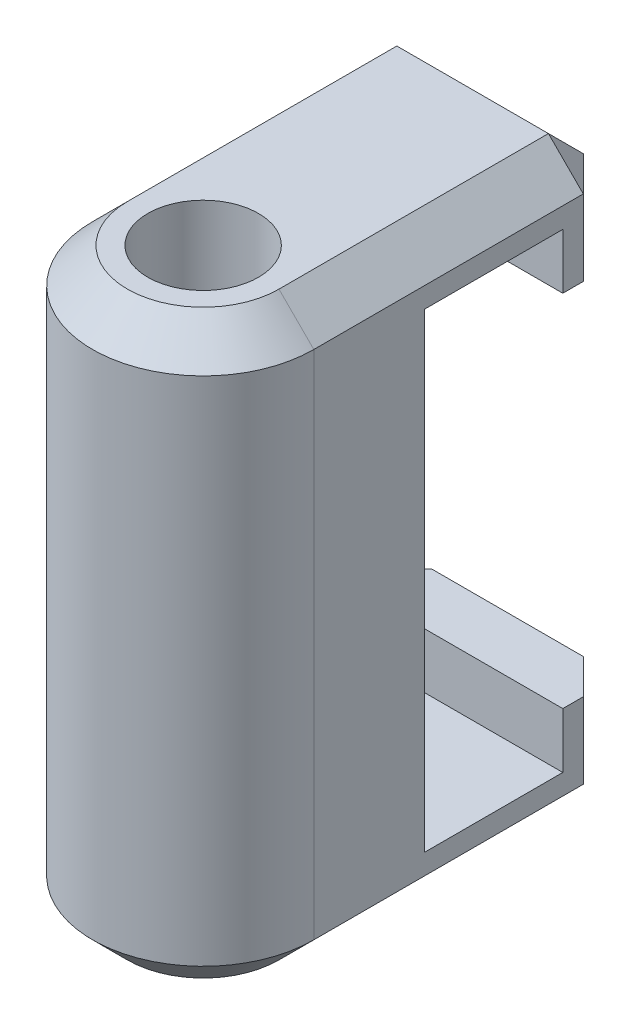
ISO-10303-21;
HEADER;
FILE_DESCRIPTION(('STEP AP214'),'2;1');
FILE_NAME('part.step','',(''),(''),'','','');
FILE_SCHEMA(('AUTOMOTIVE_DESIGN { 1 0 10303 214 1 1 1 1 }'));
ENDSEC;
DATA;
#1=APPLICATION_CONTEXT('core data for automotive mechanical design processes');
#2=APPLICATION_PROTOCOL_DEFINITION('international standard','automotive_design',2000,#1);
#3=PRODUCT_CONTEXT('',#1,'mechanical');
#4=PRODUCT('Part','Part','',(#3));
#5=PRODUCT_RELATED_PRODUCT_CATEGORY('part','',(#4));
#6=PRODUCT_DEFINITION_FORMATION('','',#4);
#7=PRODUCT_DEFINITION_CONTEXT('part definition',#1,'design');
#8=PRODUCT_DEFINITION('design','',#6,#7);
#9=PRODUCT_DEFINITION_SHAPE('','',#8);
#10=(LENGTH_UNIT() NAMED_UNIT(*) SI_UNIT(.MILLI.,.METRE.));
#11=(NAMED_UNIT(*) PLANE_ANGLE_UNIT() SI_UNIT($,.RADIAN.));
#12=(NAMED_UNIT(*) SI_UNIT($,.STERADIAN.) SOLID_ANGLE_UNIT());
#13=UNCERTAINTY_MEASURE_WITH_UNIT(LENGTH_MEASURE(1.E-05),#10,'distance_accuracy_value','');
#14=(GEOMETRIC_REPRESENTATION_CONTEXT(3) GLOBAL_UNCERTAINTY_ASSIGNED_CONTEXT((#13)) GLOBAL_UNIT_ASSIGNED_CONTEXT((#10,
#11,#12)) REPRESENTATION_CONTEXT('',''));
#15=CARTESIAN_POINT('',(0.,0.,0.));
#16=DIRECTION('',(0.,0.,1.));
#17=DIRECTION('',(1.,0.,0.));
#18=AXIS2_PLACEMENT_3D('',#15,#16,#17);
#19=CARTESIAN_POINT('',(-3.175,16.66875,-8.73125));
#20=DIRECTION('',(0.,0.,1.));
#21=DIRECTION('',(1.,0.,0.));
#22=AXIS2_PLACEMENT_3D('',#19,#20,#21);
#23=PLANE('',#22);
#24=DIRECTION('',(1.,0.,0.));
#25=VECTOR('',#24,1.);
#26=CARTESIAN_POINT('',(-3.175,3.175,-8.73125));
#27=LINE('',#26,#25);
#28=CARTESIAN_POINT('',(-2.175,3.175,-8.73125));
#29=VERTEX_POINT('',#28);
#30=CARTESIAN_POINT('',(2.175,3.175,-8.73125));
#31=VERTEX_POINT('',#30);
#32=EDGE_CURVE('E234',#29,#31,#27,.T.);
#33=ORIENTED_EDGE('',*,*,#32,.T.);
#34=DIRECTION('',(0.,-1.,0.));
#35=VECTOR('',#34,1.);
#36=CARTESIAN_POINT('',(2.175,16.66875,-8.73125));
#37=LINE('',#36,#35);
#38=CARTESIAN_POINT('',(2.175,0.999999999999997,-8.73125));
#39=VERTEX_POINT('',#38);
#40=EDGE_CURVE('E263',#31,#39,#37,.T.);
#41=ORIENTED_EDGE('',*,*,#40,.T.);
#42=DIRECTION('',(-1.,0.,0.));
#43=VECTOR('',#42,1.);
#44=CARTESIAN_POINT('',(-3.175,0.999999999999997,-8.73125));
#45=LINE('',#44,#43);
#46=CARTESIAN_POINT('',(-2.175,0.999999999999997,-8.73125));
#47=VERTEX_POINT('',#46);
#48=EDGE_CURVE('E259',#39,#47,#45,.T.);
#49=ORIENTED_EDGE('',*,*,#48,.T.);
#50=DIRECTION('',(0.,1.,0.));
#51=VECTOR('',#50,1.);
#52=CARTESIAN_POINT('',(-2.175,16.66875,-8.73125));
#53=LINE('',#52,#51);
#54=EDGE_CURVE('E261',#47,#29,#53,.T.);
#55=ORIENTED_EDGE('',*,*,#54,.T.);
#56=EDGE_LOOP('',(#33,#41,#49,#55));
#57=FACE_BOUND('',#56,.T.);
#58=ADVANCED_FACE('F35',(#57),#23,.F.);
#59=CARTESIAN_POINT('',(0.,16.66875,0.));
#60=DIRECTION('',(0.,1.,0.));
#61=DIRECTION('',(0.,0.,1.));
#62=AXIS2_PLACEMENT_3D('',#59,#60,#61);
#63=PLANE('',#62);
#64=DIRECTION('',(0.,0.,-1.));
#65=VECTOR('',#64,1.);
#66=CARTESIAN_POINT('',(2.175,16.66875,-8.73125));
#67=LINE('',#66,#65);
#68=CARTESIAN_POINT('',(2.175,16.66875,0.));
#69=VERTEX_POINT('',#68);
#70=CARTESIAN_POINT('',(2.175,16.66875,-7.73125));
#71=VERTEX_POINT('',#70);
#72=EDGE_CURVE('E309',#69,#71,#67,.T.);
#73=ORIENTED_EDGE('',*,*,#72,.T.);
#74=DIRECTION('',(-1.,0.,0.));
#75=VECTOR('',#74,1.);
#76=CARTESIAN_POINT('',(-3.175,16.66875,-7.73125));
#77=LINE('',#76,#75);
#78=CARTESIAN_POINT('',(-2.175,16.66875,-7.73125));
#79=VERTEX_POINT('',#78);
#80=EDGE_CURVE('E11',#71,#79,#77,.T.);
#81=ORIENTED_EDGE('',*,*,#80,.T.);
#82=DIRECTION('',(0.,0.,1.));
#83=VECTOR('',#82,1.);
#84=CARTESIAN_POINT('',(-2.175,16.66875,0.));
#85=LINE('',#84,#83);
#86=CARTESIAN_POINT('',(-2.175,16.66875,0.));
#87=VERTEX_POINT('',#86);
#88=EDGE_CURVE('E44',#79,#87,#85,.T.);
#89=ORIENTED_EDGE('',*,*,#88,.T.);
#90=CARTESIAN_POINT('',(0.,16.66875,0.));
#91=DIRECTION('',(0.,1.,0.));
#92=DIRECTION('',(0.,0.,1.));
#93=AXIS2_PLACEMENT_3D('',#90,#91,#92);
#94=CIRCLE('',#93,2.175);
#95=EDGE_CURVE('E311',#87,#69,#94,.T.);
#96=ORIENTED_EDGE('',*,*,#95,.T.);
#97=EDGE_LOOP('',(#73,#81,#89,#96));
#98=FACE_BOUND('',#97,.T.);
#99=CARTESIAN_POINT('',(0.,16.66875,0.));
#100=DIRECTION('',(0.,1.,0.));
#101=DIRECTION('',(0.,0.,1.));
#102=AXIS2_PLACEMENT_3D('',#99,#100,#101);
#103=CIRCLE('',#102,1.5875);
#104=CARTESIAN_POINT('',(0.,16.66875,1.5875));
#105=VERTEX_POINT('',#104);
#106=EDGE_CURVE('E248',#105,#105,#103,.T.);
#107=ORIENTED_EDGE('',*,*,#106,.F.);
#108=EDGE_LOOP('',(#107));
#109=FACE_BOUND('',#108,.T.);
#110=ADVANCED_FACE('F364',(#98,#109),#63,.T.);
#111=CARTESIAN_POINT('',(0.,0.,0.));
#112=DIRECTION('',(0.,1.,0.));
#113=DIRECTION('',(0.,0.,1.));
#114=AXIS2_PLACEMENT_3D('',#111,#112,#113);
#115=PLANE('',#114);
#116=DIRECTION('',(0.,0.,-1.));
#117=VECTOR('',#116,1.);
#118=CARTESIAN_POINT('',(-2.175,0.,0.));
#119=LINE('',#118,#117);
#120=CARTESIAN_POINT('',(-2.175,0.,0.));
#121=VERTEX_POINT('',#120);
#122=CARTESIAN_POINT('',(-2.175,0.,-7.73125));
#123=VERTEX_POINT('',#122);
#124=EDGE_CURVE('E290',#121,#123,#119,.T.);
#125=ORIENTED_EDGE('',*,*,#124,.T.);
#126=DIRECTION('',(1.,0.,0.));
#127=VECTOR('',#126,1.);
#128=CARTESIAN_POINT('',(0.,0.,-7.73125));
#129=LINE('',#128,#127);
#130=CARTESIAN_POINT('',(2.175,0.,-7.73125));
#131=VERTEX_POINT('',#130);
#132=EDGE_CURVE('E292',#123,#131,#129,.T.);
#133=ORIENTED_EDGE('',*,*,#132,.T.);
#134=DIRECTION('',(0.,0.,1.));
#135=VECTOR('',#134,1.);
#136=CARTESIAN_POINT('',(2.175,0.,0.));
#137=LINE('',#136,#135);
#138=CARTESIAN_POINT('',(2.175,0.,0.));
#139=VERTEX_POINT('',#138);
#140=EDGE_CURVE('E286',#131,#139,#137,.T.);
#141=ORIENTED_EDGE('',*,*,#140,.T.);
#142=CARTESIAN_POINT('',(0.,0.,0.));
#143=DIRECTION('',(0.,1.,0.));
#144=DIRECTION('',(0.,0.,1.));
#145=AXIS2_PLACEMENT_3D('',#142,#143,#144);
#146=CIRCLE('',#145,2.175);
#147=EDGE_CURVE('E288',#139,#121,#146,.F.);
#148=ORIENTED_EDGE('',*,*,#147,.T.);
#149=EDGE_LOOP('',(#125,#133,#141,#148));
#150=FACE_BOUND('',#149,.T.);
#151=CARTESIAN_POINT('',(0.,0.,0.));
#152=DIRECTION('',(0.,1.,0.));
#153=DIRECTION('',(0.,0.,1.));
#154=AXIS2_PLACEMENT_3D('',#151,#152,#153);
#155=CIRCLE('',#154,1.5875);
#156=CARTESIAN_POINT('',(0.,0.,1.5875));
#157=VERTEX_POINT('',#156);
#158=EDGE_CURVE('E237',#157,#157,#155,.T.);
#159=ORIENTED_EDGE('',*,*,#158,.T.);
#160=EDGE_LOOP('',(#159));
#161=FACE_BOUND('',#160,.T.);
#162=ADVANCED_FACE('F417',(#150,#161),#115,.F.);
#163=CARTESIAN_POINT('',(0.,16.66875,0.));
#164=DIRECTION('',(0.,-1.,0.));
#165=DIRECTION('',(0.,0.,-1.));
#166=AXIS2_PLACEMENT_3D('',#163,#164,#165);
#167=CYLINDRICAL_SURFACE('',#166,3.175);
#168=DIRECTION('',(0.,-1.,0.));
#169=VECTOR('',#168,1.);
#170=CARTESIAN_POINT('',(-3.175,16.66875,0.));
#171=LINE('',#170,#169);
#172=CARTESIAN_POINT('',(-3.175,15.66875,0.));
#173=VERTEX_POINT('',#172);
#174=CARTESIAN_POINT('',(-3.175,0.999999999999997,0.));
#175=VERTEX_POINT('',#174);
#176=EDGE_CURVE('E251',#173,#175,#171,.T.);
#177=ORIENTED_EDGE('',*,*,#176,.T.);
#178=CARTESIAN_POINT('',(0.,0.999999999999997,0.));
#179=DIRECTION('',(0.,1.,0.));
#180=DIRECTION('',(0.,0.,1.));
#181=AXIS2_PLACEMENT_3D('',#178,#179,#180);
#182=CIRCLE('',#181,3.175);
#183=CARTESIAN_POINT('',(3.175,0.999999999999997,0.));
#184=VERTEX_POINT('',#183);
#185=EDGE_CURVE('E297',#175,#184,#182,.T.);
#186=ORIENTED_EDGE('',*,*,#185,.T.);
#187=DIRECTION('',(0.,-1.,0.));
#188=VECTOR('',#187,1.);
#189=CARTESIAN_POINT('',(3.175,16.66875,0.));
#190=LINE('',#189,#188);
#191=CARTESIAN_POINT('',(3.175,15.66875,0.));
#192=VERTEX_POINT('',#191);
#193=EDGE_CURVE('E256',#192,#184,#190,.T.);
#194=ORIENTED_EDGE('',*,*,#193,.F.);
#195=CARTESIAN_POINT('',(0.,15.66875,0.));
#196=DIRECTION('',(0.,1.,0.));
#197=DIRECTION('',(0.,0.,1.));
#198=AXIS2_PLACEMENT_3D('',#195,#196,#197);
#199=CIRCLE('',#198,3.175);
#200=EDGE_CURVE('E295',#192,#173,#199,.F.);
#201=ORIENTED_EDGE('',*,*,#200,.T.);
#202=EDGE_LOOP('',(#177,#186,#194,#201));
#203=FACE_BOUND('',#202,.T.);
#204=ADVANCED_FACE('F378',(#203),#167,.T.);
#205=CARTESIAN_POINT('',(3.175,16.66875,-8.73125));
#206=DIRECTION('',(-1.,0.,0.));
#207=DIRECTION('',(0.,0.,1.));
#208=AXIS2_PLACEMENT_3D('',#205,#206,#207);
#209=PLANE('',#208);
#210=DIRECTION('',(0.,0.,-1.));
#211=VECTOR('',#210,1.);
#212=CARTESIAN_POINT('',(3.175,0.999999999999997,-8.73125));
#213=LINE('',#212,#211);
#214=CARTESIAN_POINT('',(3.175,0.999999999999997,-7.73125));
#215=VERTEX_POINT('',#214);
#216=EDGE_CURVE('E270',#184,#215,#213,.T.);
#217=ORIENTED_EDGE('',*,*,#216,.T.);
#218=DIRECTION('',(0.,1.,0.));
#219=VECTOR('',#218,1.);
#220=CARTESIAN_POINT('',(3.175,16.66875,-7.73125));
#221=LINE('',#220,#219);
#222=CARTESIAN_POINT('',(3.175,3.175,-7.73125));
#223=VERTEX_POINT('',#222);
#224=EDGE_CURVE('E272',#215,#223,#221,.T.);
#225=ORIENTED_EDGE('',*,*,#224,.T.);
#226=DIRECTION('',(0.,0.,-1.));
#227=VECTOR('',#226,1.);
#228=CARTESIAN_POINT('',(3.175,3.175,-7.14375));
#229=LINE('',#228,#227);
#230=CARTESIAN_POINT('',(3.175,3.175,-7.14375));
#231=VERTEX_POINT('',#230);
#232=EDGE_CURVE('E204',#231,#223,#229,.T.);
#233=ORIENTED_EDGE('',*,*,#232,.F.);
#234=DIRECTION('',(0.,1.,0.));
#235=VECTOR('',#234,1.);
#236=CARTESIAN_POINT('',(3.175,1.5875,-7.14375));
#237=LINE('',#236,#235);
#238=CARTESIAN_POINT('',(3.175,1.5875,-7.14375));
#239=VERTEX_POINT('',#238);
#240=EDGE_CURVE('E229',#239,#231,#237,.T.);
#241=ORIENTED_EDGE('',*,*,#240,.F.);
#242=DIRECTION('',(0.,0.,-1.));
#243=VECTOR('',#242,1.);
#244=CARTESIAN_POINT('',(3.175,1.5875,-3.175));
#245=LINE('',#244,#243);
#246=CARTESIAN_POINT('',(3.175,1.5875,-3.175));
#247=VERTEX_POINT('',#246);
#248=EDGE_CURVE('E226',#247,#239,#245,.T.);
#249=ORIENTED_EDGE('',*,*,#248,.F.);
#250=DIRECTION('',(0.,-1.,0.));
#251=VECTOR('',#250,1.);
#252=CARTESIAN_POINT('',(3.175,15.08125,-3.175));
#253=LINE('',#252,#251);
#254=CARTESIAN_POINT('',(3.175,15.08125,-3.175));
#255=VERTEX_POINT('',#254);
#256=EDGE_CURVE('E223',#255,#247,#253,.T.);
#257=ORIENTED_EDGE('',*,*,#256,.F.);
#258=DIRECTION('',(0.,0.,1.));
#259=VECTOR('',#258,1.);
#260=CARTESIAN_POINT('',(3.175,15.08125,-7.14375));
#261=LINE('',#260,#259);
#262=CARTESIAN_POINT('',(3.175,15.08125,-7.14375));
#263=VERTEX_POINT('',#262);
#264=EDGE_CURVE('E221',#263,#255,#261,.T.);
#265=ORIENTED_EDGE('',*,*,#264,.F.);
#266=DIRECTION('',(0.,1.,0.));
#267=VECTOR('',#266,1.);
#268=CARTESIAN_POINT('',(3.175,13.49375,-7.14375));
#269=LINE('',#268,#267);
#270=CARTESIAN_POINT('',(3.175,13.49375,-7.14375));
#271=VERTEX_POINT('',#270);
#272=EDGE_CURVE('E183',#271,#263,#269,.T.);
#273=ORIENTED_EDGE('',*,*,#272,.F.);
#274=DIRECTION('',(0.,0.,1.));
#275=VECTOR('',#274,1.);
#276=CARTESIAN_POINT('',(3.175,13.49375,-8.73125));
#277=LINE('',#276,#275);
#278=CARTESIAN_POINT('',(3.175,13.49375,-7.73124999999999));
#279=VERTEX_POINT('',#278);
#280=EDGE_CURVE('E217',#279,#271,#277,.T.);
#281=ORIENTED_EDGE('',*,*,#280,.F.);
#282=DIRECTION('',(0.,1.,0.));
#283=VECTOR('',#282,1.);
#284=CARTESIAN_POINT('',(3.175,16.66875,-7.73124999999999));
#285=LINE('',#284,#283);
#286=CARTESIAN_POINT('',(3.175,15.66875,-7.73124999999999));
#287=VERTEX_POINT('',#286);
#288=EDGE_CURVE('E268',#279,#287,#285,.T.);
#289=ORIENTED_EDGE('',*,*,#288,.T.);
#290=DIRECTION('',(0.,0.,1.));
#291=VECTOR('',#290,1.);
#292=CARTESIAN_POINT('',(3.175,15.66875,0.));
#293=LINE('',#292,#291);
#294=EDGE_CURVE('E266',#287,#192,#293,.T.);
#295=ORIENTED_EDGE('',*,*,#294,.T.);
#296=ORIENTED_EDGE('',*,*,#193,.T.);
#297=EDGE_LOOP('',(#217,#225,#233,#241,#249,#257,#265,#273,#281,#289,#295,#296));
#298=FACE_BOUND('',#297,.T.);
#299=ADVANCED_FACE('F374',(#298),#209,.F.);
#300=DIRECTION('',(1.,0.,0.));
#301=VECTOR('',#300,1.);
#302=CARTESIAN_POINT('',(-3.175,13.49375,-8.73125));
#303=LINE('',#302,#301);
#304=CARTESIAN_POINT('',(-2.17499999999999,13.49375,-8.73125));
#305=VERTEX_POINT('',#304);
#306=CARTESIAN_POINT('',(2.175,13.49375,-8.73125));
#307=VERTEX_POINT('',#306);
#308=EDGE_CURVE('E216',#305,#307,#303,.T.);
#309=ORIENTED_EDGE('',*,*,#308,.F.);
#310=DIRECTION('',(0.,1.,0.));
#311=VECTOR('',#310,1.);
#312=CARTESIAN_POINT('',(-2.17499999999999,16.66875,-8.73125));
#313=LINE('',#312,#311);
#314=CARTESIAN_POINT('',(-2.17499999999999,15.66875,-8.73125));
#315=VERTEX_POINT('',#314);
#316=EDGE_CURVE('E307',#305,#315,#313,.T.);
#317=ORIENTED_EDGE('',*,*,#316,.T.);
#318=DIRECTION('',(1.,0.,0.));
#319=VECTOR('',#318,1.);
#320=CARTESIAN_POINT('',(3.175,15.66875,-8.73125));
#321=LINE('',#320,#319);
#322=CARTESIAN_POINT('',(2.175,15.66875,-8.73125));
#323=VERTEX_POINT('',#322);
#324=EDGE_CURVE('E303',#315,#323,#321,.T.);
#325=ORIENTED_EDGE('',*,*,#324,.T.);
#326=DIRECTION('',(0.,-1.,0.));
#327=VECTOR('',#326,1.);
#328=CARTESIAN_POINT('',(2.175,16.66875,-8.73125));
#329=LINE('',#328,#327);
#330=EDGE_CURVE('E305',#323,#307,#329,.T.);
#331=ORIENTED_EDGE('',*,*,#330,.T.);
#332=EDGE_LOOP('',(#309,#317,#325,#331));
#333=FACE_BOUND('',#332,.T.);
#334=ADVANCED_FACE('F435',(#333),#23,.F.);
#335=CARTESIAN_POINT('',(-3.175,16.66875,0.));
#336=DIRECTION('',(1.,0.,0.));
#337=DIRECTION('',(0.,0.,-1.));
#338=AXIS2_PLACEMENT_3D('',#335,#336,#337);
#339=PLANE('',#338);
#340=DIRECTION('',(0.,0.,-1.));
#341=VECTOR('',#340,1.);
#342=CARTESIAN_POINT('',(-3.175,3.175,-7.14375));
#343=LINE('',#342,#341);
#344=CARTESIAN_POINT('',(-3.175,3.175,-7.14375));
#345=VERTEX_POINT('',#344);
#346=CARTESIAN_POINT('',(-3.175,3.175,-7.73125));
#347=VERTEX_POINT('',#346);
#348=EDGE_CURVE('E214',#345,#347,#343,.T.);
#349=ORIENTED_EDGE('',*,*,#348,.T.);
#350=DIRECTION('',(0.,-1.,0.));
#351=VECTOR('',#350,1.);
#352=CARTESIAN_POINT('',(-3.175,16.66875,-7.73125));
#353=LINE('',#352,#351);
#354=CARTESIAN_POINT('',(-3.175,0.999999999999997,-7.73125));
#355=VERTEX_POINT('',#354);
#356=EDGE_CURVE('E284',#347,#355,#353,.T.);
#357=ORIENTED_EDGE('',*,*,#356,.T.);
#358=DIRECTION('',(0.,0.,1.));
#359=VECTOR('',#358,1.);
#360=CARTESIAN_POINT('',(-3.175,0.999999999999997,0.));
#361=LINE('',#360,#359);
#362=EDGE_CURVE('E282',#355,#175,#361,.T.);
#363=ORIENTED_EDGE('',*,*,#362,.T.);
#364=ORIENTED_EDGE('',*,*,#176,.F.);
#365=DIRECTION('',(0.,0.,-1.));
#366=VECTOR('',#365,1.);
#367=CARTESIAN_POINT('',(-3.175,15.66875,-8.73125));
#368=LINE('',#367,#366);
#369=CARTESIAN_POINT('',(-3.175,15.66875,-7.73125));
#370=VERTEX_POINT('',#369);
#371=EDGE_CURVE('E278',#173,#370,#368,.T.);
#372=ORIENTED_EDGE('',*,*,#371,.T.);
#373=DIRECTION('',(0.,-1.,0.));
#374=VECTOR('',#373,1.);
#375=CARTESIAN_POINT('',(-3.175,16.66875,-7.73125));
#376=LINE('',#375,#374);
#377=CARTESIAN_POINT('',(-3.175,13.49375,-7.73125));
#378=VERTEX_POINT('',#377);
#379=EDGE_CURVE('E280',#370,#378,#376,.T.);
#380=ORIENTED_EDGE('',*,*,#379,.T.);
#381=DIRECTION('',(0.,0.,1.));
#382=VECTOR('',#381,1.);
#383=CARTESIAN_POINT('',(-3.175,13.49375,-8.73125));
#384=LINE('',#383,#382);
#385=CARTESIAN_POINT('',(-3.175,13.49375,-7.14375));
#386=VERTEX_POINT('',#385);
#387=EDGE_CURVE('E202',#378,#386,#384,.T.);
#388=ORIENTED_EDGE('',*,*,#387,.T.);
#389=DIRECTION('',(0.,1.,0.));
#390=VECTOR('',#389,1.);
#391=CARTESIAN_POINT('',(-3.175,13.49375,-7.14375));
#392=LINE('',#391,#390);
#393=CARTESIAN_POINT('',(-3.175,15.08125,-7.14375));
#394=VERTEX_POINT('',#393);
#395=EDGE_CURVE('E180',#386,#394,#392,.T.);
#396=ORIENTED_EDGE('',*,*,#395,.T.);
#397=DIRECTION('',(0.,0.,1.));
#398=VECTOR('',#397,1.);
#399=CARTESIAN_POINT('',(-3.175,15.08125,-7.14375));
#400=LINE('',#399,#398);
#401=CARTESIAN_POINT('',(-3.175,15.08125,-3.175));
#402=VERTEX_POINT('',#401);
#403=EDGE_CURVE('E191',#394,#402,#400,.T.);
#404=ORIENTED_EDGE('',*,*,#403,.T.);
#405=DIRECTION('',(0.,-1.,0.));
#406=VECTOR('',#405,1.);
#407=CARTESIAN_POINT('',(-3.175,15.08125,-3.175));
#408=LINE('',#407,#406);
#409=CARTESIAN_POINT('',(-3.175,1.5875,-3.175));
#410=VERTEX_POINT('',#409);
#411=EDGE_CURVE('E196',#402,#410,#408,.T.);
#412=ORIENTED_EDGE('',*,*,#411,.T.);
#413=DIRECTION('',(0.,0.,-1.));
#414=VECTOR('',#413,1.);
#415=CARTESIAN_POINT('',(-3.175,1.5875,-3.175));
#416=LINE('',#415,#414);
#417=CARTESIAN_POINT('',(-3.175,1.5875,-7.14375));
#418=VERTEX_POINT('',#417);
#419=EDGE_CURVE('E208',#410,#418,#416,.T.);
#420=ORIENTED_EDGE('',*,*,#419,.T.);
#421=DIRECTION('',(0.,1.,0.));
#422=VECTOR('',#421,1.);
#423=CARTESIAN_POINT('',(-3.175,1.5875,-7.14375));
#424=LINE('',#423,#422);
#425=EDGE_CURVE('E211',#418,#345,#424,.T.);
#426=ORIENTED_EDGE('',*,*,#425,.T.);
#427=EDGE_LOOP('',(#349,#357,#363,#364,#372,#380,#388,#396,#404,#412,#420,#426));
#428=FACE_BOUND('',#427,.T.);
#429=ADVANCED_FACE('F199',(#428),#339,.F.);
#430=CARTESIAN_POINT('',(0.,16.66875,0.));
#431=DIRECTION('',(0.,-1.,0.));
#432=DIRECTION('',(0.,0.,-1.));
#433=AXIS2_PLACEMENT_3D('',#430,#431,#432);
#434=CYLINDRICAL_SURFACE('',#433,1.5875);
#435=ORIENTED_EDGE('',*,*,#106,.T.);
#436=EDGE_LOOP('',(#435));
#437=FACE_BOUND('',#436,.T.);
#438=ORIENTED_EDGE('',*,*,#158,.F.);
#439=EDGE_LOOP('',(#438));
#440=FACE_BOUND('',#439,.T.);
#441=ADVANCED_FACE('F449',(#437,#440),#434,.F.);
#442=CARTESIAN_POINT('',(-3.175,3.175,-7.14375));
#443=DIRECTION('',(0.,-1.,0.));
#444=DIRECTION('',(0.,0.,-1.));
#445=AXIS2_PLACEMENT_3D('',#442,#443,#444);
#446=PLANE('',#445);
#447=ORIENTED_EDGE('',*,*,#232,.T.);
#448=DIRECTION('',(0.707106781186548,0.,0.707106781186547));
#449=VECTOR('',#448,1.);
#450=CARTESIAN_POINT('',(2.175,3.175,-8.73125));
#451=LINE('',#450,#449);
#452=EDGE_CURVE('E276',#223,#31,#451,.F.);
#453=ORIENTED_EDGE('',*,*,#452,.T.);
#454=ORIENTED_EDGE('',*,*,#32,.F.);
#455=DIRECTION('',(0.707106781186548,0.,-0.707106781186547));
#456=VECTOR('',#455,1.);
#457=CARTESIAN_POINT('',(-3.175,3.175,-7.73125));
#458=LINE('',#457,#456);
#459=EDGE_CURVE('E274',#29,#347,#458,.F.);
#460=ORIENTED_EDGE('',*,*,#459,.T.);
#461=ORIENTED_EDGE('',*,*,#348,.F.);
#462=DIRECTION('',(1.,0.,0.));
#463=VECTOR('',#462,1.);
#464=CARTESIAN_POINT('',(-3.175,3.175,-7.14375));
#465=LINE('',#464,#463);
#466=EDGE_CURVE('E238',#345,#231,#465,.T.);
#467=ORIENTED_EDGE('',*,*,#466,.T.);
#468=EDGE_LOOP('',(#447,#453,#454,#460,#461,#467));
#469=FACE_BOUND('',#468,.T.);
#470=ADVANCED_FACE('F397',(#469),#446,.F.);
#471=CARTESIAN_POINT('',(-3.175,1.5875,-7.14375));
#472=DIRECTION('',(0.,0.,-1.));
#473=DIRECTION('',(-1.,0.,0.));
#474=AXIS2_PLACEMENT_3D('',#471,#472,#473);
#475=PLANE('',#474);
#476=ORIENTED_EDGE('',*,*,#240,.T.);
#477=ORIENTED_EDGE('',*,*,#466,.F.);
#478=ORIENTED_EDGE('',*,*,#425,.F.);
#479=DIRECTION('',(1.,0.,0.));
#480=VECTOR('',#479,1.);
#481=CARTESIAN_POINT('',(-3.175,1.5875,-7.14375));
#482=LINE('',#481,#480);
#483=EDGE_CURVE('E240',#418,#239,#482,.T.);
#484=ORIENTED_EDGE('',*,*,#483,.T.);
#485=EDGE_LOOP('',(#476,#477,#478,#484));
#486=FACE_BOUND('',#485,.T.);
#487=ADVANCED_FACE('F493',(#486),#475,.F.);
#488=CARTESIAN_POINT('',(-3.175,1.5875,-3.175));
#489=DIRECTION('',(0.,-1.,0.));
#490=DIRECTION('',(0.,0.,-1.));
#491=AXIS2_PLACEMENT_3D('',#488,#489,#490);
#492=PLANE('',#491);
#493=ORIENTED_EDGE('',*,*,#248,.T.);
#494=ORIENTED_EDGE('',*,*,#483,.F.);
#495=ORIENTED_EDGE('',*,*,#419,.F.);
#496=DIRECTION('',(1.,0.,0.));
#497=VECTOR('',#496,1.);
#498=CARTESIAN_POINT('',(-3.175,1.5875,-3.175));
#499=LINE('',#498,#497);
#500=EDGE_CURVE('E242',#410,#247,#499,.T.);
#501=ORIENTED_EDGE('',*,*,#500,.T.);
#502=EDGE_LOOP('',(#493,#494,#495,#501));
#503=FACE_BOUND('',#502,.T.);
#504=ADVANCED_FACE('F491',(#503),#492,.F.);
#505=CARTESIAN_POINT('',(-3.175,15.08125,-3.175));
#506=DIRECTION('',(0.,0.,1.));
#507=DIRECTION('',(0.,-1.,0.));
#508=AXIS2_PLACEMENT_3D('',#505,#506,#507);
#509=PLANE('',#508);
#510=ORIENTED_EDGE('',*,*,#256,.T.);
#511=ORIENTED_EDGE('',*,*,#500,.F.);
#512=ORIENTED_EDGE('',*,*,#411,.F.);
#513=DIRECTION('',(1.,0.,0.));
#514=VECTOR('',#513,1.);
#515=CARTESIAN_POINT('',(-3.175,15.08125,-3.175));
#516=LINE('',#515,#514);
#517=EDGE_CURVE('E187',#402,#255,#516,.T.);
#518=ORIENTED_EDGE('',*,*,#517,.T.);
#519=EDGE_LOOP('',(#510,#511,#512,#518));
#520=FACE_BOUND('',#519,.T.);
#521=ADVANCED_FACE('F487',(#520),#509,.F.);
#522=CARTESIAN_POINT('',(-3.175,15.08125,-7.14375));
#523=DIRECTION('',(0.,1.,0.));
#524=DIRECTION('',(0.,0.,1.));
#525=AXIS2_PLACEMENT_3D('',#522,#523,#524);
#526=PLANE('',#525);
#527=ORIENTED_EDGE('',*,*,#264,.T.);
#528=ORIENTED_EDGE('',*,*,#517,.F.);
#529=ORIENTED_EDGE('',*,*,#403,.F.);
#530=DIRECTION('',(1.,0.,0.));
#531=VECTOR('',#530,1.);
#532=CARTESIAN_POINT('',(-3.175,15.08125,-7.14375));
#533=LINE('',#532,#531);
#534=EDGE_CURVE('E175',#394,#263,#533,.T.);
#535=ORIENTED_EDGE('',*,*,#534,.T.);
#536=EDGE_LOOP('',(#527,#528,#529,#535));
#537=FACE_BOUND('',#536,.T.);
#538=ADVANCED_FACE('F192',(#537),#526,.F.);
#539=CARTESIAN_POINT('',(-3.175,13.49375,-7.14375));
#540=DIRECTION('',(0.,0.,-1.));
#541=DIRECTION('',(0.,1.,0.));
#542=AXIS2_PLACEMENT_3D('',#539,#540,#541);
#543=PLANE('',#542);
#544=ORIENTED_EDGE('',*,*,#272,.T.);
#545=ORIENTED_EDGE('',*,*,#534,.F.);
#546=ORIENTED_EDGE('',*,*,#395,.F.);
#547=DIRECTION('',(1.,0.,0.));
#548=VECTOR('',#547,1.);
#549=CARTESIAN_POINT('',(-3.175,13.49375,-7.14375));
#550=LINE('',#549,#548);
#551=EDGE_CURVE('E188',#386,#271,#550,.T.);
#552=ORIENTED_EDGE('',*,*,#551,.T.);
#553=EDGE_LOOP('',(#544,#545,#546,#552));
#554=FACE_BOUND('',#553,.T.);
#555=ADVANCED_FACE('F177',(#554),#543,.F.);
#556=CARTESIAN_POINT('',(-3.175,13.49375,-8.73125));
#557=DIRECTION('',(0.,1.,0.));
#558=DIRECTION('',(0.,0.,1.));
#559=AXIS2_PLACEMENT_3D('',#556,#557,#558);
#560=PLANE('',#559);
#561=ORIENTED_EDGE('',*,*,#387,.F.);
#562=DIRECTION('',(-0.707106781186549,0.,0.707106781186546));
#563=VECTOR('',#562,1.);
#564=CARTESIAN_POINT('',(-3.175,13.49375,-7.73125));
#565=LINE('',#564,#563);
#566=EDGE_CURVE('E301',#378,#305,#565,.F.);
#567=ORIENTED_EDGE('',*,*,#566,.T.);
#568=ORIENTED_EDGE('',*,*,#308,.T.);
#569=DIRECTION('',(-0.707106781186546,0.,-0.707106781186549));
#570=VECTOR('',#569,1.);
#571=CARTESIAN_POINT('',(2.175,13.49375,-8.73125));
#572=LINE('',#571,#570);
#573=EDGE_CURVE('E299',#307,#279,#572,.F.);
#574=ORIENTED_EDGE('',*,*,#573,.T.);
#575=ORIENTED_EDGE('',*,*,#280,.T.);
#576=ORIENTED_EDGE('',*,*,#551,.F.);
#577=EDGE_LOOP('',(#561,#567,#568,#574,#575,#576));
#578=FACE_BOUND('',#577,.T.);
#579=ADVANCED_FACE('F483',(#578),#560,.F.);
#580=CARTESIAN_POINT('',(-3.175,16.66875,-7.73125));
#581=DIRECTION('',(0.707106781186547,0.,0.707106781186548));
#582=DIRECTION('',(0.,-1.,0.));
#583=AXIS2_PLACEMENT_3D('',#580,#581,#582);
#584=PLANE('',#583);
#585=ORIENTED_EDGE('',*,*,#459,.F.);
#586=ORIENTED_EDGE('',*,*,#54,.F.);
#587=DIRECTION('',(-0.707106781186548,0.,0.707106781186547));
#588=VECTOR('',#587,1.);
#589=CARTESIAN_POINT('',(-3.175,0.999999999999997,-7.73125));
#590=LINE('',#589,#588);
#591=EDGE_CURVE('E219',#355,#47,#590,.F.);
#592=ORIENTED_EDGE('',*,*,#591,.F.);
#593=ORIENTED_EDGE('',*,*,#356,.F.);
#594=EDGE_LOOP('',(#585,#586,#592,#593));
#595=FACE_BOUND('',#594,.T.);
#596=ADVANCED_FACE('F408',(#595),#584,.F.);
#597=CARTESIAN_POINT('',(-3.175,0.999999999999997,0.));
#598=DIRECTION('',(0.707106781186546,0.707106781186549,0.));
#599=DIRECTION('',(0.,0.,1.));
#600=AXIS2_PLACEMENT_3D('',#597,#598,#599);
#601=PLANE('',#600);
#602=DIRECTION('',(0.707106781186549,-0.707106781186546,0.));
#603=VECTOR('',#602,1.);
#604=CARTESIAN_POINT('',(-3.175,0.999999999999997,0.));
#605=LINE('',#604,#603);
#606=EDGE_CURVE('E327',#175,#121,#605,.T.);
#607=ORIENTED_EDGE('',*,*,#606,.F.);
#608=ORIENTED_EDGE('',*,*,#362,.F.);
#609=DIRECTION('',(0.707106781186549,-0.707106781186546,0.));
#610=VECTOR('',#609,1.);
#611=CARTESIAN_POINT('',(-3.175,0.999999999999997,-7.73125));
#612=LINE('',#611,#610);
#613=EDGE_CURVE('E330',#123,#355,#612,.F.);
#614=ORIENTED_EDGE('',*,*,#613,.F.);
#615=ORIENTED_EDGE('',*,*,#124,.F.);
#616=EDGE_LOOP('',(#607,#608,#614,#615));
#617=FACE_BOUND('',#616,.T.);
#618=ADVANCED_FACE('F413',(#617),#601,.F.);
#619=CARTESIAN_POINT('',(-3.175,0.999999999999997,-7.73125));
#620=DIRECTION('',(-0.577350269189625,-0.577350269189627,-0.577350269189625));
#621=DIRECTION('',(0.,0.707106781186546,-0.707106781186549));
#622=AXIS2_PLACEMENT_3D('',#619,#620,#621);
#623=PLANE('',#622);
#624=ORIENTED_EDGE('',*,*,#613,.T.);
#625=ORIENTED_EDGE('',*,*,#591,.T.);
#626=DIRECTION('',(0.,0.707106781186546,-0.707106781186549));
#627=VECTOR('',#626,1.);
#628=CARTESIAN_POINT('',(-2.175,0.499999999999998,-8.23125));
#629=LINE('',#628,#627);
#630=EDGE_CURVE('E324',#123,#47,#629,.T.);
#631=ORIENTED_EDGE('',*,*,#630,.F.);
#632=EDGE_LOOP('',(#624,#625,#631));
#633=FACE_BOUND('',#632,.T.);
#634=ADVANCED_FACE('F567',(#633),#623,.T.);
#635=CARTESIAN_POINT('',(0.,0.999999999999997,0.));
#636=DIRECTION('',(0.,1.,0.));
#637=DIRECTION('',(0.,0.,1.));
#638=AXIS2_PLACEMENT_3D('',#635,#636,#637);
#639=CONICAL_SURFACE('',#638,3.175,0.78539816339745);
#640=ORIENTED_EDGE('',*,*,#606,.T.);
#641=ORIENTED_EDGE('',*,*,#147,.F.);
#642=DIRECTION('',(-0.707106781186549,-0.707106781186546,0.));
#643=VECTOR('',#642,1.);
#644=CARTESIAN_POINT('',(3.175,0.999999999999997,0.));
#645=LINE('',#644,#643);
#646=EDGE_CURVE('E321',#184,#139,#645,.T.);
#647=ORIENTED_EDGE('',*,*,#646,.F.);
#648=ORIENTED_EDGE('',*,*,#185,.F.);
#649=EDGE_LOOP('',(#640,#641,#647,#648));
#650=FACE_BOUND('',#649,.T.);
#651=ADVANCED_FACE('F383',(#650),#639,.T.);
#652=CARTESIAN_POINT('',(-3.175,0.999999999999997,-8.73125));
#653=DIRECTION('',(0.,0.707106781186549,0.707106781186546));
#654=DIRECTION('',(-1.,0.,0.));
#655=AXIS2_PLACEMENT_3D('',#652,#653,#654);
#656=PLANE('',#655);
#657=ORIENTED_EDGE('',*,*,#630,.T.);
#658=ORIENTED_EDGE('',*,*,#48,.F.);
#659=DIRECTION('',(0.,-0.707106781186546,0.707106781186549));
#660=VECTOR('',#659,1.);
#661=CARTESIAN_POINT('',(2.175,0.999999999999997,-8.73125));
#662=LINE('',#661,#660);
#663=EDGE_CURVE('E318',#131,#39,#662,.F.);
#664=ORIENTED_EDGE('',*,*,#663,.F.);
#665=ORIENTED_EDGE('',*,*,#132,.F.);
#666=EDGE_LOOP('',(#657,#658,#664,#665));
#667=FACE_BOUND('',#666,.T.);
#668=ADVANCED_FACE('F422',(#667),#656,.F.);
#669=CARTESIAN_POINT('',(3.175,0.999999999999997,-8.73125));
#670=DIRECTION('',(-0.707106781186546,0.707106781186549,0.));
#671=DIRECTION('',(0.,0.,-1.));
#672=AXIS2_PLACEMENT_3D('',#669,#670,#671);
#673=PLANE('',#672);
#674=ORIENTED_EDGE('',*,*,#646,.T.);
#675=ORIENTED_EDGE('',*,*,#140,.F.);
#676=DIRECTION('',(0.707106781186549,0.707106781186546,0.));
#677=VECTOR('',#676,1.);
#678=CARTESIAN_POINT('',(2.675,0.499999999999998,-7.73125));
#679=LINE('',#678,#677);
#680=EDGE_CURVE('E316',#215,#131,#679,.F.);
#681=ORIENTED_EDGE('',*,*,#680,.F.);
#682=ORIENTED_EDGE('',*,*,#216,.F.);
#683=EDGE_LOOP('',(#674,#675,#681,#682));
#684=FACE_BOUND('',#683,.T.);
#685=ADVANCED_FACE('F389',(#684),#673,.F.);
#686=CARTESIAN_POINT('',(2.175,0.999999999999997,-8.73125));
#687=DIRECTION('',(0.577350269189624,-0.577350269189628,-0.577350269189625));
#688=DIRECTION('',(0.,0.707106781186546,-0.707106781186549));
#689=AXIS2_PLACEMENT_3D('',#686,#687,#688);
#690=PLANE('',#689);
#691=ORIENTED_EDGE('',*,*,#680,.T.);
#692=ORIENTED_EDGE('',*,*,#663,.T.);
#693=DIRECTION('',(-0.707106781186548,0.,-0.707106781186547));
#694=VECTOR('',#693,1.);
#695=CARTESIAN_POINT('',(2.175,0.999999999999997,-8.73125));
#696=LINE('',#695,#694);
#697=EDGE_CURVE('E314',#215,#39,#696,.T.);
#698=ORIENTED_EDGE('',*,*,#697,.F.);
#699=EDGE_LOOP('',(#691,#692,#698));
#700=FACE_BOUND('',#699,.T.);
#701=ADVANCED_FACE('F424',(#700),#690,.T.);
#702=CARTESIAN_POINT('',(2.175,16.66875,-8.73125));
#703=DIRECTION('',(-0.707106781186547,0.,0.707106781186548));
#704=DIRECTION('',(0.,-1.,0.));
#705=AXIS2_PLACEMENT_3D('',#702,#703,#704);
#706=PLANE('',#705);
#707=ORIENTED_EDGE('',*,*,#452,.F.);
#708=ORIENTED_EDGE('',*,*,#224,.F.);
#709=ORIENTED_EDGE('',*,*,#697,.T.);
#710=ORIENTED_EDGE('',*,*,#40,.F.);
#711=EDGE_LOOP('',(#707,#708,#709,#710));
#712=FACE_BOUND('',#711,.T.);
#713=ADVANCED_FACE('F401',(#712),#706,.F.);
#714=CARTESIAN_POINT('',(2.175,16.66875,-8.73125));
#715=DIRECTION('',(-0.707106781186549,0.,0.707106781186546));
#716=DIRECTION('',(0.,-1.,0.));
#717=AXIS2_PLACEMENT_3D('',#714,#715,#716);
#718=PLANE('',#717);
#719=ORIENTED_EDGE('',*,*,#573,.F.);
#720=ORIENTED_EDGE('',*,*,#330,.F.);
#721=DIRECTION('',(0.707106781186546,0.,0.707106781186549));
#722=VECTOR('',#721,1.);
#723=CARTESIAN_POINT('',(3.175,15.66875,-7.73124999999999));
#724=LINE('',#723,#722);
#725=EDGE_CURVE('E39',#287,#323,#724,.F.);
#726=ORIENTED_EDGE('',*,*,#725,.F.);
#727=ORIENTED_EDGE('',*,*,#288,.F.);
#728=EDGE_LOOP('',(#719,#720,#726,#727));
#729=FACE_BOUND('',#728,.T.);
#730=ADVANCED_FACE('F37',(#729),#718,.F.);
#731=CARTESIAN_POINT('',(2.175,16.66875,0.));
#732=DIRECTION('',(0.707106781186549,0.707106781186546,0.));
#733=DIRECTION('',(0.,0.,1.));
#734=AXIS2_PLACEMENT_3D('',#731,#732,#733);
#735=PLANE('',#734);
#736=DIRECTION('',(-0.707106781186546,0.707106781186549,0.));
#737=VECTOR('',#736,1.);
#738=CARTESIAN_POINT('',(3.175,15.66875,0.));
#739=LINE('',#738,#737);
#740=EDGE_CURVE('E347',#192,#69,#739,.T.);
#741=ORIENTED_EDGE('',*,*,#740,.F.);
#742=ORIENTED_EDGE('',*,*,#294,.F.);
#743=DIRECTION('',(0.707106781186546,-0.707106781186549,0.));
#744=VECTOR('',#743,1.);
#745=CARTESIAN_POINT('',(3.175,15.66875,-7.73124999999999));
#746=LINE('',#745,#744);
#747=EDGE_CURVE('E349',#71,#287,#746,.T.);
#748=ORIENTED_EDGE('',*,*,#747,.F.);
#749=ORIENTED_EDGE('',*,*,#72,.F.);
#750=EDGE_LOOP('',(#741,#742,#748,#749));
#751=FACE_BOUND('',#750,.T.);
#752=ADVANCED_FACE('F370',(#751),#735,.T.);
#753=CARTESIAN_POINT('',(3.175,15.66875,-7.73124999999999));
#754=DIRECTION('',(0.577350269189629,0.577350269189623,-0.577350269189626));
#755=DIRECTION('',(-0.707106781186546,0.,-0.707106781186549));
#756=AXIS2_PLACEMENT_3D('',#753,#754,#755);
#757=PLANE('',#756);
#758=ORIENTED_EDGE('',*,*,#747,.T.);
#759=ORIENTED_EDGE('',*,*,#725,.T.);
#760=DIRECTION('',(0.,0.707106781186549,0.707106781186546));
#761=VECTOR('',#760,1.);
#762=CARTESIAN_POINT('',(2.175,16.16875,-8.23125));
#763=LINE('',#762,#761);
#764=EDGE_CURVE('E344',#71,#323,#763,.F.);
#765=ORIENTED_EDGE('',*,*,#764,.F.);
#766=EDGE_LOOP('',(#758,#759,#765));
#767=FACE_BOUND('',#766,.T.);
#768=ADVANCED_FACE('F356',(#767),#757,.T.);
#769=CARTESIAN_POINT('',(0.,16.66875,0.));
#770=DIRECTION('',(0.,-1.,0.));
#771=DIRECTION('',(0.,0.,-1.));
#772=AXIS2_PLACEMENT_3D('',#769,#770,#771);
#773=CONICAL_SURFACE('',#772,2.175,0.785398163397446);
#774=ORIENTED_EDGE('',*,*,#740,.T.);
#775=ORIENTED_EDGE('',*,*,#95,.F.);
#776=DIRECTION('',(0.707106781186546,0.707106781186549,0.));
#777=VECTOR('',#776,1.);
#778=CARTESIAN_POINT('',(-3.175,15.66875,0.));
#779=LINE('',#778,#777);
#780=EDGE_CURVE('E341',#173,#87,#779,.T.);
#781=ORIENTED_EDGE('',*,*,#780,.F.);
#782=ORIENTED_EDGE('',*,*,#200,.F.);
#783=EDGE_LOOP('',(#774,#775,#781,#782));
#784=FACE_BOUND('',#783,.T.);
#785=ADVANCED_FACE('F472',(#784),#773,.T.);
#786=CARTESIAN_POINT('',(0.,16.66875,-7.73125));
#787=DIRECTION('',(0.,0.707106781186546,-0.707106781186549));
#788=DIRECTION('',(1.,0.,0.));
#789=AXIS2_PLACEMENT_3D('',#786,#787,#788);
#790=PLANE('',#789);
#791=ORIENTED_EDGE('',*,*,#764,.T.);
#792=ORIENTED_EDGE('',*,*,#324,.F.);
#793=DIRECTION('',(0.,-0.707106781186549,-0.707106781186546));
#794=VECTOR('',#793,1.);
#795=CARTESIAN_POINT('',(-2.17499999999999,15.66875,-8.73125));
#796=LINE('',#795,#794);
#797=EDGE_CURVE('E339',#79,#315,#796,.T.);
#798=ORIENTED_EDGE('',*,*,#797,.F.);
#799=ORIENTED_EDGE('',*,*,#80,.F.);
#800=EDGE_LOOP('',(#791,#792,#798,#799));
#801=FACE_BOUND('',#800,.T.);
#802=ADVANCED_FACE('F363',(#801),#790,.T.);
#803=CARTESIAN_POINT('',(-2.175,16.66875,0.));
#804=DIRECTION('',(-0.707106781186549,0.707106781186546,0.));
#805=DIRECTION('',(0.,0.,-1.));
#806=AXIS2_PLACEMENT_3D('',#803,#804,#805);
#807=PLANE('',#806);
#808=ORIENTED_EDGE('',*,*,#780,.T.);
#809=ORIENTED_EDGE('',*,*,#88,.F.);
#810=DIRECTION('',(0.707106781186546,0.707106781186549,0.));
#811=VECTOR('',#810,1.);
#812=CARTESIAN_POINT('',(-2.675,16.16875,-7.73125));
#813=LINE('',#812,#811);
#814=EDGE_CURVE('E52',#370,#79,#813,.T.);
#815=ORIENTED_EDGE('',*,*,#814,.F.);
#816=ORIENTED_EDGE('',*,*,#371,.F.);
#817=EDGE_LOOP('',(#808,#809,#815,#816));
#818=FACE_BOUND('',#817,.T.);
#819=ADVANCED_FACE('F459',(#818),#807,.T.);
#820=CARTESIAN_POINT('',(-2.17499999999999,15.66875,-8.73125));
#821=DIRECTION('',(-0.577350269189626,0.577350269189623,-0.577350269189629));
#822=DIRECTION('',(-0.707106781186549,0.,0.707106781186546));
#823=AXIS2_PLACEMENT_3D('',#820,#821,#822);
#824=PLANE('',#823);
#825=ORIENTED_EDGE('',*,*,#814,.T.);
#826=ORIENTED_EDGE('',*,*,#797,.T.);
#827=DIRECTION('',(0.707106781186549,0.,-0.707106781186546));
#828=VECTOR('',#827,1.);
#829=CARTESIAN_POINT('',(-2.17499999999999,15.66875,-8.73125));
#830=LINE('',#829,#828);
#831=EDGE_CURVE('E335',#370,#315,#830,.T.);
#832=ORIENTED_EDGE('',*,*,#831,.F.);
#833=EDGE_LOOP('',(#825,#826,#832));
#834=FACE_BOUND('',#833,.T.);
#835=ADVANCED_FACE('F457',(#834),#824,.T.);
#836=CARTESIAN_POINT('',(-3.175,16.66875,-7.73125));
#837=DIRECTION('',(0.707106781186546,0.,0.707106781186549));
#838=DIRECTION('',(0.,-1.,0.));
#839=AXIS2_PLACEMENT_3D('',#836,#837,#838);
#840=PLANE('',#839);
#841=ORIENTED_EDGE('',*,*,#831,.T.);
#842=ORIENTED_EDGE('',*,*,#316,.F.);
#843=ORIENTED_EDGE('',*,*,#566,.F.);
#844=ORIENTED_EDGE('',*,*,#379,.F.);
#845=EDGE_LOOP('',(#841,#842,#843,#844));
#846=FACE_BOUND('',#845,.T.);
#847=ADVANCED_FACE('F455',(#846),#840,.F.);
#848=CLOSED_SHELL('',(#58,#110,#162,#204,#299,#334,#429,#441,#470,#487,#504,#521,#538,#555,#579,
#596,#618,#634,#651,#668,#685,#701,#713,#730,#752,#768,#785,#802,#819,#835,#847));
#849=MANIFOLD_SOLID_BREP('B2',#848);
#850=ADVANCED_BREP_SHAPE_REPRESENTATION('',(#18,#849),#14);
#851=SHAPE_DEFINITION_REPRESENTATION(#9,#850);
ENDSEC;
END-ISO-10303-21;
